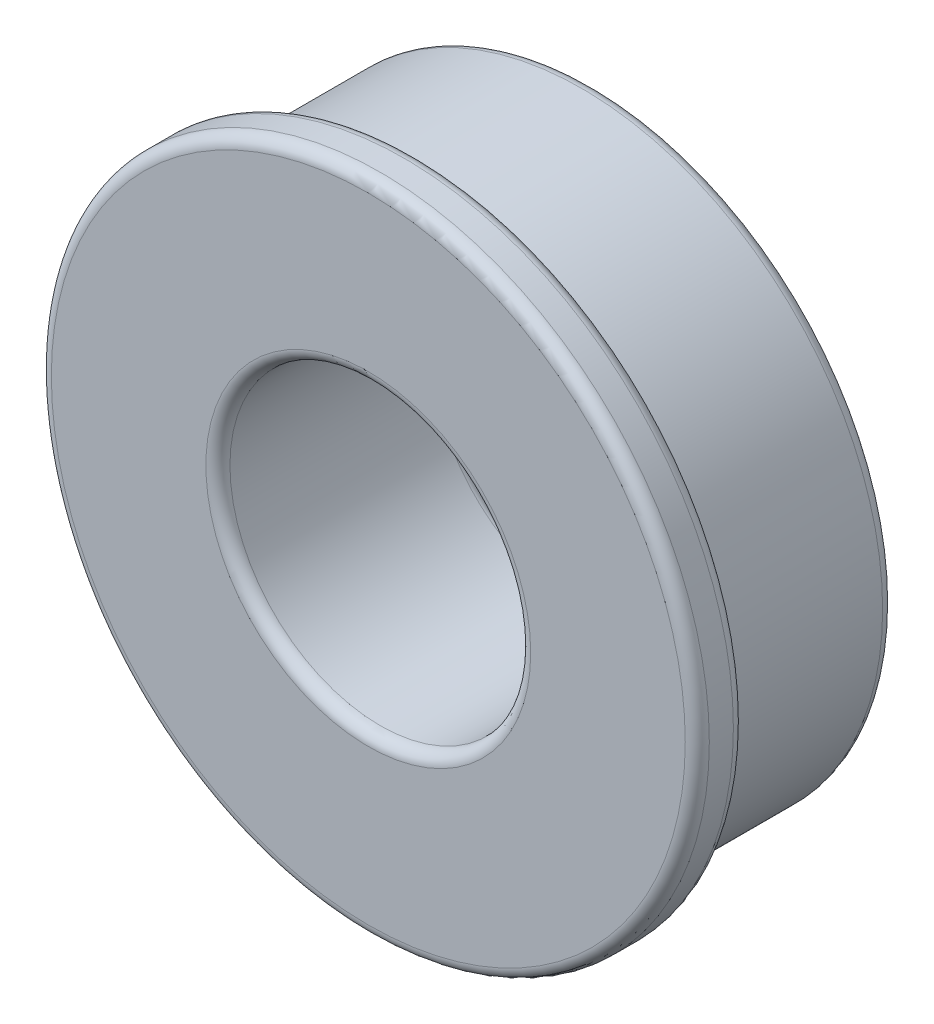
ISO-10303-21;
HEADER;
FILE_DESCRIPTION(('STEP AP214'),'2;1');
FILE_NAME('part.step','',(''),(''),'','','');
FILE_SCHEMA(('AUTOMOTIVE_DESIGN { 1 0 10303 214 1 1 1 1 }'));
ENDSEC;
DATA;
#1=APPLICATION_CONTEXT('core data for automotive mechanical design processes');
#2=APPLICATION_PROTOCOL_DEFINITION('international standard','automotive_design',2000,#1);
#3=PRODUCT_CONTEXT('',#1,'mechanical');
#4=PRODUCT('Part','Part','',(#3));
#5=PRODUCT_RELATED_PRODUCT_CATEGORY('part','',(#4));
#6=PRODUCT_DEFINITION_FORMATION('','',#4);
#7=PRODUCT_DEFINITION_CONTEXT('part definition',#1,'design');
#8=PRODUCT_DEFINITION('design','',#6,#7);
#9=PRODUCT_DEFINITION_SHAPE('','',#8);
#10=(LENGTH_UNIT() NAMED_UNIT(*) SI_UNIT(.MILLI.,.METRE.));
#11=(NAMED_UNIT(*) PLANE_ANGLE_UNIT() SI_UNIT($,.RADIAN.));
#12=(NAMED_UNIT(*) SI_UNIT($,.STERADIAN.) SOLID_ANGLE_UNIT());
#13=UNCERTAINTY_MEASURE_WITH_UNIT(LENGTH_MEASURE(1.E-05),#10,'distance_accuracy_value','');
#14=(GEOMETRIC_REPRESENTATION_CONTEXT(3) GLOBAL_UNCERTAINTY_ASSIGNED_CONTEXT((#13)) GLOBAL_UNIT_ASSIGNED_CONTEXT((#10,
#11,#12)) REPRESENTATION_CONTEXT('',''));
#15=CARTESIAN_POINT('',(0.,0.,0.));
#16=DIRECTION('',(0.,0.,1.));
#17=DIRECTION('',(1.,0.,0.));
#18=AXIS2_PLACEMENT_3D('',#15,#16,#17);
#19=CARTESIAN_POINT('',(0.,0.,4.7625));
#20=DIRECTION('',(0.,0.,-1.));
#21=DIRECTION('',(-1.,0.,0.));
#22=AXIS2_PLACEMENT_3D('',#19,#20,#21);
#23=CYLINDRICAL_SURFACE('',#22,6.35);
#24=CARTESIAN_POINT('',(0.,0.,3.4925));
#25=DIRECTION('',(0.,0.,1.));
#26=DIRECTION('',(1.,0.,0.));
#27=AXIS2_PLACEMENT_3D('',#24,#25,#26);
#28=CIRCLE('',#27,6.35);
#29=CARTESIAN_POINT('',(6.35,0.,3.4925));
#30=VERTEX_POINT('',#29);
#31=EDGE_CURVE('E54',#30,#30,#28,.F.);
#32=ORIENTED_EDGE('',*,*,#31,.T.);
#33=EDGE_LOOP('',(#32));
#34=FACE_BOUND('',#33,.T.);
#35=CARTESIAN_POINT('',(0.,0.,0.254));
#36=DIRECTION('',(0.,0.,1.));
#37=DIRECTION('',(1.,0.,0.));
#38=AXIS2_PLACEMENT_3D('',#35,#36,#37);
#39=CIRCLE('',#38,6.35);
#40=CARTESIAN_POINT('',(6.35,0.,0.254));
#41=VERTEX_POINT('',#40);
#42=EDGE_CURVE('E57',#41,#41,#39,.T.);
#43=ORIENTED_EDGE('',*,*,#42,.T.);
#44=EDGE_LOOP('',(#43));
#45=FACE_BOUND('',#44,.T.);
#46=ADVANCED_FACE('F34',(#34,#45),#23,.T.);
#47=CARTESIAN_POINT('',(0.,0.,0.));
#48=DIRECTION('',(0.,0.,1.));
#49=DIRECTION('',(1.,0.,0.));
#50=AXIS2_PLACEMENT_3D('',#47,#48,#49);
#51=PLANE('',#50);
#52=CARTESIAN_POINT('',(0.,0.,0.));
#53=DIRECTION('',(0.,0.,1.));
#54=DIRECTION('',(1.,0.,0.));
#55=AXIS2_PLACEMENT_3D('',#52,#53,#54);
#56=CIRCLE('',#55,6.096);
#57=CARTESIAN_POINT('',(6.096,0.,0.));
#58=VERTEX_POINT('',#57);
#59=EDGE_CURVE('E45',#58,#58,#56,.F.);
#60=ORIENTED_EDGE('',*,*,#59,.T.);
#61=EDGE_LOOP('',(#60));
#62=FACE_BOUND('',#61,.T.);
#63=CARTESIAN_POINT('',(0.,0.,0.));
#64=DIRECTION('',(0.,0.,1.));
#65=DIRECTION('',(1.,0.,0.));
#66=AXIS2_PLACEMENT_3D('',#63,#64,#65);
#67=CIRCLE('',#66,3.429);
#68=CARTESIAN_POINT('',(3.429,0.,0.));
#69=VERTEX_POINT('',#68);
#70=EDGE_CURVE('E49',#69,#69,#67,.T.);
#71=ORIENTED_EDGE('',*,*,#70,.T.);
#72=EDGE_LOOP('',(#71));
#73=FACE_BOUND('',#72,.T.);
#74=ADVANCED_FACE('F95',(#62,#73),#51,.F.);
#75=CARTESIAN_POINT('',(0.,0.,3.7465));
#76=DIRECTION('',(0.,0.,1.));
#77=DIRECTION('',(1.,0.,0.));
#78=AXIS2_PLACEMENT_3D('',#75,#76,#77);
#79=CYLINDRICAL_SURFACE('',#78,6.9453125);
#80=CARTESIAN_POINT('',(0.,0.,4.0005));
#81=DIRECTION('',(0.,0.,1.));
#82=DIRECTION('',(1.,0.,0.));
#83=AXIS2_PLACEMENT_3D('',#80,#81,#82);
#84=CIRCLE('',#83,6.9453125);
#85=CARTESIAN_POINT('',(6.9453125,0.,4.0005));
#86=VERTEX_POINT('',#85);
#87=EDGE_CURVE('E10',#86,#86,#84,.T.);
#88=ORIENTED_EDGE('',*,*,#87,.T.);
#89=EDGE_LOOP('',(#88));
#90=FACE_BOUND('',#89,.T.);
#91=CARTESIAN_POINT('',(0.,0.,4.5085));
#92=DIRECTION('',(0.,0.,1.));
#93=DIRECTION('',(1.,0.,0.));
#94=AXIS2_PLACEMENT_3D('',#91,#92,#93);
#95=CIRCLE('',#94,6.9453125);
#96=CARTESIAN_POINT('',(6.9453125,0.,4.5085));
#97=VERTEX_POINT('',#96);
#98=EDGE_CURVE('E41',#97,#97,#95,.F.);
#99=ORIENTED_EDGE('',*,*,#98,.T.);
#100=EDGE_LOOP('',(#99));
#101=FACE_BOUND('',#100,.T.);
#102=ADVANCED_FACE('F101',(#90,#101),#79,.T.);
#103=CARTESIAN_POINT('',(0.,0.,3.7465));
#104=DIRECTION('',(0.,0.,1.));
#105=DIRECTION('',(1.,0.,0.));
#106=AXIS2_PLACEMENT_3D('',#103,#104,#105);
#107=PLANE('',#106);
#108=CARTESIAN_POINT('',(0.,0.,3.7465));
#109=DIRECTION('',(0.,0.,1.));
#110=DIRECTION('',(1.,0.,0.));
#111=AXIS2_PLACEMENT_3D('',#108,#109,#110);
#112=CIRCLE('',#111,6.604);
#113=CARTESIAN_POINT('',(6.604,0.,3.7465));
#114=VERTEX_POINT('',#113);
#115=EDGE_CURVE('E60',#114,#114,#112,.T.);
#116=ORIENTED_EDGE('',*,*,#115,.T.);
#117=EDGE_LOOP('',(#116));
#118=FACE_BOUND('',#117,.T.);
#119=CARTESIAN_POINT('',(0.,0.,3.7465));
#120=DIRECTION('',(0.,0.,1.));
#121=DIRECTION('',(1.,0.,0.));
#122=AXIS2_PLACEMENT_3D('',#119,#120,#121);
#123=CIRCLE('',#122,6.6913125);
#124=CARTESIAN_POINT('',(6.6913125,0.,3.7465));
#125=VERTEX_POINT('',#124);
#126=EDGE_CURVE('E63',#125,#125,#123,.F.);
#127=ORIENTED_EDGE('',*,*,#126,.T.);
#128=EDGE_LOOP('',(#127));
#129=FACE_BOUND('',#128,.T.);
#130=ADVANCED_FACE('F170',(#118,#129),#107,.F.);
#131=CARTESIAN_POINT('',(0.,0.,4.7625));
#132=DIRECTION('',(0.,0.,1.));
#133=DIRECTION('',(1.,0.,0.));
#134=AXIS2_PLACEMENT_3D('',#131,#132,#133);
#135=PLANE('',#134);
#136=CARTESIAN_POINT('',(0.,0.,4.7625));
#137=DIRECTION('',(0.,0.,1.));
#138=DIRECTION('',(1.,0.,0.));
#139=AXIS2_PLACEMENT_3D('',#136,#137,#138);
#140=CIRCLE('',#139,3.429);
#141=CARTESIAN_POINT('',(3.429,0.,4.7625));
#142=VERTEX_POINT('',#141);
#143=EDGE_CURVE('E66',#142,#142,#140,.F.);
#144=ORIENTED_EDGE('',*,*,#143,.T.);
#145=EDGE_LOOP('',(#144));
#146=FACE_BOUND('',#145,.T.);
#147=CARTESIAN_POINT('',(0.,0.,4.7625));
#148=DIRECTION('',(0.,0.,1.));
#149=DIRECTION('',(1.,0.,0.));
#150=AXIS2_PLACEMENT_3D('',#147,#148,#149);
#151=CIRCLE('',#150,6.6913125);
#152=CARTESIAN_POINT('',(6.6913125,0.,4.7625));
#153=VERTEX_POINT('',#152);
#154=EDGE_CURVE('E69',#153,#153,#151,.T.);
#155=ORIENTED_EDGE('',*,*,#154,.T.);
#156=EDGE_LOOP('',(#155));
#157=FACE_BOUND('',#156,.T.);
#158=ADVANCED_FACE('F160',(#146,#157),#135,.T.);
#159=CARTESIAN_POINT('',(0.,0.,-8.98025612106915));
#160=DIRECTION('',(0.,0.,1.));
#161=DIRECTION('',(1.,0.,0.));
#162=AXIS2_PLACEMENT_3D('',#159,#160,#161);
#163=CYLINDRICAL_SURFACE('',#162,3.175);
#164=CARTESIAN_POINT('',(0.,0.,4.5085));
#165=DIRECTION('',(0.,0.,1.));
#166=DIRECTION('',(1.,0.,0.));
#167=AXIS2_PLACEMENT_3D('',#164,#165,#166);
#168=CIRCLE('',#167,3.175);
#169=CARTESIAN_POINT('',(3.175,0.,4.5085));
#170=VERTEX_POINT('',#169);
#171=EDGE_CURVE('E72',#170,#170,#168,.T.);
#172=ORIENTED_EDGE('',*,*,#171,.T.);
#173=EDGE_LOOP('',(#172));
#174=FACE_BOUND('',#173,.T.);
#175=CARTESIAN_POINT('',(0.,0.,0.254000000000001));
#176=DIRECTION('',(0.,0.,1.));
#177=DIRECTION('',(1.,0.,0.));
#178=AXIS2_PLACEMENT_3D('',#175,#176,#177);
#179=CIRCLE('',#178,3.175);
#180=CARTESIAN_POINT('',(3.175,0.,0.254000000000001));
#181=VERTEX_POINT('',#180);
#182=EDGE_CURVE('E75',#181,#181,#179,.F.);
#183=ORIENTED_EDGE('',*,*,#182,.T.);
#184=EDGE_LOOP('',(#183));
#185=FACE_BOUND('',#184,.T.);
#186=ADVANCED_FACE('F79',(#174,#185),#163,.F.);
#187=CARTESIAN_POINT('',(0.,0.,4.5085));
#188=DIRECTION('',(0.,0.,1.));
#189=DIRECTION('',(1.,0.,0.));
#190=AXIS2_PLACEMENT_3D('',#187,#188,#189);
#191=TOROIDAL_SURFACE('',#190,3.429,0.254);
#192=ORIENTED_EDGE('',*,*,#143,.F.);
#193=EDGE_LOOP('',(#192));
#194=FACE_BOUND('',#193,.T.);
#195=ORIENTED_EDGE('',*,*,#171,.F.);
#196=EDGE_LOOP('',(#195));
#197=FACE_BOUND('',#196,.T.);
#198=ADVANCED_FACE('F107',(#194,#197),#191,.T.);
#199=CARTESIAN_POINT('',(0.,0.,3.4925));
#200=DIRECTION('',(0.,0.,1.));
#201=DIRECTION('',(1.,0.,0.));
#202=AXIS2_PLACEMENT_3D('',#199,#200,#201);
#203=TOROIDAL_SURFACE('',#202,6.604,0.254);
#204=ORIENTED_EDGE('',*,*,#31,.F.);
#205=EDGE_LOOP('',(#204));
#206=FACE_BOUND('',#205,.T.);
#207=ORIENTED_EDGE('',*,*,#115,.F.);
#208=EDGE_LOOP('',(#207));
#209=FACE_BOUND('',#208,.T.);
#210=ADVANCED_FACE('F110',(#206,#209),#203,.F.);
#211=CARTESIAN_POINT('',(0.,0.,0.254));
#212=DIRECTION('',(0.,0.,1.));
#213=DIRECTION('',(1.,0.,0.));
#214=AXIS2_PLACEMENT_3D('',#211,#212,#213);
#215=TOROIDAL_SURFACE('',#214,6.096,0.254);
#216=ORIENTED_EDGE('',*,*,#59,.F.);
#217=EDGE_LOOP('',(#216));
#218=FACE_BOUND('',#217,.T.);
#219=ORIENTED_EDGE('',*,*,#42,.F.);
#220=EDGE_LOOP('',(#219));
#221=FACE_BOUND('',#220,.T.);
#222=ADVANCED_FACE('F90',(#218,#221),#215,.T.);
#223=CARTESIAN_POINT('',(0.,0.,4.0005));
#224=DIRECTION('',(0.,0.,1.));
#225=DIRECTION('',(1.,0.,0.));
#226=AXIS2_PLACEMENT_3D('',#223,#224,#225);
#227=TOROIDAL_SURFACE('',#226,6.6913125,0.254);
#228=ORIENTED_EDGE('',*,*,#126,.F.);
#229=EDGE_LOOP('',(#228));
#230=FACE_BOUND('',#229,.T.);
#231=ORIENTED_EDGE('',*,*,#87,.F.);
#232=EDGE_LOOP('',(#231));
#233=FACE_BOUND('',#232,.T.);
#234=ADVANCED_FACE('F83',(#230,#233),#227,.T.);
#235=CARTESIAN_POINT('',(0.,0.,0.254000000000001));
#236=DIRECTION('',(0.,0.,1.));
#237=DIRECTION('',(1.,0.,0.));
#238=AXIS2_PLACEMENT_3D('',#235,#236,#237);
#239=TOROIDAL_SURFACE('',#238,3.429,0.254);
#240=ORIENTED_EDGE('',*,*,#70,.F.);
#241=EDGE_LOOP('',(#240));
#242=FACE_BOUND('',#241,.T.);
#243=ORIENTED_EDGE('',*,*,#182,.F.);
#244=EDGE_LOOP('',(#243));
#245=FACE_BOUND('',#244,.T.);
#246=ADVANCED_FACE('F81',(#242,#245),#239,.T.);
#247=CARTESIAN_POINT('',(0.,0.,4.5085));
#248=DIRECTION('',(0.,0.,1.));
#249=DIRECTION('',(1.,0.,0.));
#250=AXIS2_PLACEMENT_3D('',#247,#248,#249);
#251=TOROIDAL_SURFACE('',#250,6.6913125,0.254);
#252=ORIENTED_EDGE('',*,*,#98,.F.);
#253=EDGE_LOOP('',(#252));
#254=FACE_BOUND('',#253,.T.);
#255=ORIENTED_EDGE('',*,*,#154,.F.);
#256=EDGE_LOOP('',(#255));
#257=FACE_BOUND('',#256,.T.);
#258=ADVANCED_FACE('F36',(#254,#257),#251,.T.);
#259=CLOSED_SHELL('',(#46,#74,#102,#130,#158,#186,#198,#210,#222,#234,#246,#258));
#260=MANIFOLD_SOLID_BREP('B2',#259);
#261=ADVANCED_BREP_SHAPE_REPRESENTATION('',(#18,#260),#14);
#262=SHAPE_DEFINITION_REPRESENTATION(#9,#261);
ENDSEC;
END-ISO-10303-21;
